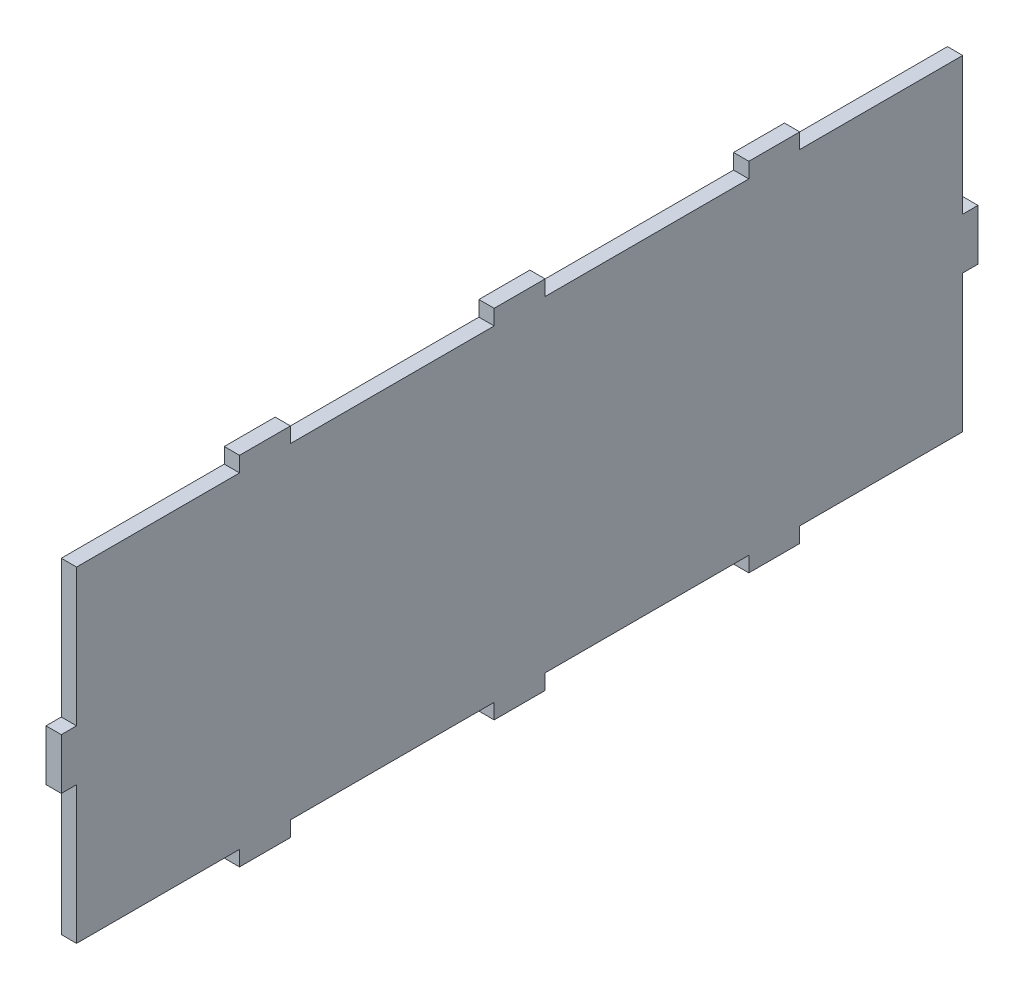
ISO-10303-21;
HEADER;
FILE_DESCRIPTION(('STEP AP214'),'2;1');
FILE_NAME('part.step','',(''),(''),'','','');
FILE_SCHEMA(('AUTOMOTIVE_DESIGN { 1 0 10303 214 1 1 1 1 }'));
ENDSEC;
DATA;
#1=APPLICATION_CONTEXT('core data for automotive mechanical design processes');
#2=APPLICATION_PROTOCOL_DEFINITION('international standard','automotive_design',2000,#1);
#3=PRODUCT_CONTEXT('',#1,'mechanical');
#4=PRODUCT('Part','Part','',(#3));
#5=PRODUCT_RELATED_PRODUCT_CATEGORY('part','',(#4));
#6=PRODUCT_DEFINITION_FORMATION('','',#4);
#7=PRODUCT_DEFINITION_CONTEXT('part definition',#1,'design');
#8=PRODUCT_DEFINITION('design','',#6,#7);
#9=PRODUCT_DEFINITION_SHAPE('','',#8);
#10=(LENGTH_UNIT() NAMED_UNIT(*) SI_UNIT(.MILLI.,.METRE.));
#11=(NAMED_UNIT(*) PLANE_ANGLE_UNIT() SI_UNIT($,.RADIAN.));
#12=(NAMED_UNIT(*) SI_UNIT($,.STERADIAN.) SOLID_ANGLE_UNIT());
#13=UNCERTAINTY_MEASURE_WITH_UNIT(LENGTH_MEASURE(1.E-05),#10,'distance_accuracy_value','');
#14=(GEOMETRIC_REPRESENTATION_CONTEXT(3) GLOBAL_UNCERTAINTY_ASSIGNED_CONTEXT((#13)) GLOBAL_UNIT_ASSIGNED_CONTEXT((#10,
#11,#12)) REPRESENTATION_CONTEXT('',''));
#15=CARTESIAN_POINT('',(0.,0.,0.));
#16=DIRECTION('',(0.,0.,1.));
#17=DIRECTION('',(1.,0.,0.));
#18=AXIS2_PLACEMENT_3D('',#15,#16,#17);
#19=CARTESIAN_POINT('',(3.,35.,-90.));
#20=DIRECTION('',(0.,0.,1.));
#21=DIRECTION('',(0.,-1.,0.));
#22=AXIS2_PLACEMENT_3D('',#19,#20,#21);
#23=PLANE('',#22);
#24=DIRECTION('',(1.,0.,0.));
#25=VECTOR('',#24,1.);
#26=CARTESIAN_POINT('',(-7.,5.,-90.));
#27=LINE('',#26,#25);
#28=CARTESIAN_POINT('',(0.,5.,-90.));
#29=VERTEX_POINT('',#28);
#30=CARTESIAN_POINT('',(3.,5.,-90.));
#31=VERTEX_POINT('',#30);
#32=EDGE_CURVE('E341',#29,#31,#27,.T.);
#33=ORIENTED_EDGE('',*,*,#32,.T.);
#34=DIRECTION('',(0.,1.,0.));
#35=VECTOR('',#34,1.);
#36=CARTESIAN_POINT('',(3.,35.,-90.));
#37=LINE('',#36,#35);
#38=CARTESIAN_POINT('',(3.,-5.,-90.));
#39=VERTEX_POINT('',#38);
#40=EDGE_CURVE('E448',#39,#31,#37,.T.);
#41=ORIENTED_EDGE('',*,*,#40,.F.);
#42=DIRECTION('',(1.,0.,0.));
#43=VECTOR('',#42,1.);
#44=CARTESIAN_POINT('',(-7.,-5.,-90.));
#45=LINE('',#44,#43);
#46=CARTESIAN_POINT('',(0.,-5.,-90.));
#47=VERTEX_POINT('',#46);
#48=EDGE_CURVE('E442',#47,#39,#45,.T.);
#49=ORIENTED_EDGE('',*,*,#48,.F.);
#50=DIRECTION('',(0.,1.,0.));
#51=VECTOR('',#50,1.);
#52=CARTESIAN_POINT('',(0.,35.,-90.));
#53=LINE('',#52,#51);
#54=EDGE_CURVE('E439',#47,#29,#53,.T.);
#55=ORIENTED_EDGE('',*,*,#54,.T.);
#56=EDGE_LOOP('',(#33,#41,#49,#55));
#57=FACE_BOUND('',#56,.T.);
#58=ADVANCED_FACE('F39',(#57),#23,.F.);
#59=CARTESIAN_POINT('',(3.,35.,90.));
#60=DIRECTION('',(0.,-1.,0.));
#61=DIRECTION('',(0.,0.,-1.));
#62=AXIS2_PLACEMENT_3D('',#59,#60,#61);
#63=PLANE('',#62);
#64=DIRECTION('',(1.,0.,0.));
#65=VECTOR('',#64,1.);
#66=CARTESIAN_POINT('',(-7.,35.,55.));
#67=LINE('',#66,#65);
#68=CARTESIAN_POINT('',(0.,35.,55.));
#69=VERTEX_POINT('',#68);
#70=CARTESIAN_POINT('',(3.,35.,55.));
#71=VERTEX_POINT('',#70);
#72=EDGE_CURVE('E417',#69,#71,#67,.T.);
#73=ORIENTED_EDGE('',*,*,#72,.T.);
#74=DIRECTION('',(0.,0.,1.));
#75=VECTOR('',#74,1.);
#76=CARTESIAN_POINT('',(3.,35.,90.));
#77=LINE('',#76,#75);
#78=CARTESIAN_POINT('',(3.,35.,45.));
#79=VERTEX_POINT('',#78);
#80=EDGE_CURVE('E451',#79,#71,#77,.T.);
#81=ORIENTED_EDGE('',*,*,#80,.F.);
#82=DIRECTION('',(1.,0.,0.));
#83=VECTOR('',#82,1.);
#84=CARTESIAN_POINT('',(-7.,35.,45.));
#85=LINE('',#84,#83);
#86=CARTESIAN_POINT('',(0.,35.,45.));
#87=VERTEX_POINT('',#86);
#88=EDGE_CURVE('E304',#87,#79,#85,.T.);
#89=ORIENTED_EDGE('',*,*,#88,.F.);
#90=DIRECTION('',(0.,0.,1.));
#91=VECTOR('',#90,1.);
#92=CARTESIAN_POINT('',(0.,35.,90.));
#93=LINE('',#92,#91);
#94=EDGE_CURVE('E466',#87,#69,#93,.T.);
#95=ORIENTED_EDGE('',*,*,#94,.T.);
#96=EDGE_LOOP('',(#73,#81,#89,#95));
#97=FACE_BOUND('',#96,.T.);
#98=ADVANCED_FACE('F614',(#97),#63,.F.);
#99=DIRECTION('',(1.,0.,0.));
#100=VECTOR('',#99,1.);
#101=CARTESIAN_POINT('',(-7.,35.,5.));
#102=LINE('',#101,#100);
#103=CARTESIAN_POINT('',(0.,35.,5.00000000000003));
#104=VERTEX_POINT('',#103);
#105=CARTESIAN_POINT('',(3.,35.,5.));
#106=VERTEX_POINT('',#105);
#107=EDGE_CURVE('E280',#104,#106,#102,.T.);
#108=ORIENTED_EDGE('',*,*,#107,.T.);
#109=CARTESIAN_POINT('',(3.,35.,-5.));
#110=VERTEX_POINT('',#109);
#111=EDGE_CURVE('E298',#110,#106,#77,.T.);
#112=ORIENTED_EDGE('',*,*,#111,.F.);
#113=DIRECTION('',(1.,0.,0.));
#114=VECTOR('',#113,1.);
#115=CARTESIAN_POINT('',(-7.,35.,-5.));
#116=LINE('',#115,#114);
#117=CARTESIAN_POINT('',(0.,35.,-5.));
#118=VERTEX_POINT('',#117);
#119=EDGE_CURVE('E319',#118,#110,#116,.T.);
#120=ORIENTED_EDGE('',*,*,#119,.F.);
#121=EDGE_CURVE('E469',#118,#104,#93,.T.);
#122=ORIENTED_EDGE('',*,*,#121,.T.);
#123=EDGE_LOOP('',(#108,#112,#120,#122));
#124=FACE_BOUND('',#123,.T.);
#125=ADVANCED_FACE('F622',(#124),#63,.F.);
#126=DIRECTION('',(1.,0.,0.));
#127=VECTOR('',#126,1.);
#128=CARTESIAN_POINT('',(-7.,35.,-45.));
#129=LINE('',#128,#127);
#130=CARTESIAN_POINT('',(0.,35.,-44.9999999999999));
#131=VERTEX_POINT('',#130);
#132=CARTESIAN_POINT('',(3.,35.,-45.));
#133=VERTEX_POINT('',#132);
#134=EDGE_CURVE('E321',#131,#133,#129,.T.);
#135=ORIENTED_EDGE('',*,*,#134,.T.);
#136=CARTESIAN_POINT('',(3.,35.,-55.));
#137=VERTEX_POINT('',#136);
#138=EDGE_CURVE('E455',#137,#133,#77,.T.);
#139=ORIENTED_EDGE('',*,*,#138,.F.);
#140=DIRECTION('',(1.,0.,0.));
#141=VECTOR('',#140,1.);
#142=CARTESIAN_POINT('',(-7.,35.,-55.));
#143=LINE('',#142,#141);
#144=CARTESIAN_POINT('',(0.,35.,-55.));
#145=VERTEX_POINT('',#144);
#146=EDGE_CURVE('E339',#145,#137,#143,.T.);
#147=ORIENTED_EDGE('',*,*,#146,.F.);
#148=EDGE_CURVE('E470',#145,#131,#93,.T.);
#149=ORIENTED_EDGE('',*,*,#148,.T.);
#150=EDGE_LOOP('',(#135,#139,#147,#149));
#151=FACE_BOUND('',#150,.T.);
#152=ADVANCED_FACE('F627',(#151),#63,.F.);
#153=CARTESIAN_POINT('',(3.,35.,90.));
#154=DIRECTION('',(0.,0.,-1.));
#155=DIRECTION('',(0.,1.,0.));
#156=AXIS2_PLACEMENT_3D('',#153,#154,#155);
#157=PLANE('',#156);
#158=DIRECTION('',(1.,0.,0.));
#159=VECTOR('',#158,1.);
#160=CARTESIAN_POINT('',(-7.,-5.,90.));
#161=LINE('',#160,#159);
#162=CARTESIAN_POINT('',(0.,-5.,90.));
#163=VERTEX_POINT('',#162);
#164=CARTESIAN_POINT('',(3.,-5.,90.));
#165=VERTEX_POINT('',#164);
#166=EDGE_CURVE('E396',#163,#165,#161,.T.);
#167=ORIENTED_EDGE('',*,*,#166,.T.);
#168=DIRECTION('',(0.,-1.,0.));
#169=VECTOR('',#168,1.);
#170=CARTESIAN_POINT('',(3.,35.,90.));
#171=LINE('',#170,#169);
#172=CARTESIAN_POINT('',(3.,5.,90.));
#173=VERTEX_POINT('',#172);
#174=EDGE_CURVE('E456',#173,#165,#171,.T.);
#175=ORIENTED_EDGE('',*,*,#174,.F.);
#176=DIRECTION('',(1.,0.,0.));
#177=VECTOR('',#176,1.);
#178=CARTESIAN_POINT('',(-7.,5.,90.));
#179=LINE('',#178,#177);
#180=CARTESIAN_POINT('',(0.,5.,90.));
#181=VERTEX_POINT('',#180);
#182=EDGE_CURVE('E385',#181,#173,#179,.T.);
#183=ORIENTED_EDGE('',*,*,#182,.F.);
#184=DIRECTION('',(0.,-1.,0.));
#185=VECTOR('',#184,1.);
#186=CARTESIAN_POINT('',(0.,35.,90.));
#187=LINE('',#186,#185);
#188=EDGE_CURVE('E471',#181,#163,#187,.T.);
#189=ORIENTED_EDGE('',*,*,#188,.T.);
#190=EDGE_LOOP('',(#167,#175,#183,#189));
#191=FACE_BOUND('',#190,.T.);
#192=ADVANCED_FACE('F594',(#191),#157,.F.);
#193=CARTESIAN_POINT('',(3.,-35.,90.));
#194=DIRECTION('',(0.,1.,0.));
#195=DIRECTION('',(0.,0.,1.));
#196=AXIS2_PLACEMENT_3D('',#193,#194,#195);
#197=PLANE('',#196);
#198=DIRECTION('',(1.,0.,0.));
#199=VECTOR('',#198,1.);
#200=CARTESIAN_POINT('',(-7.,-35.,-5.));
#201=LINE('',#200,#199);
#202=CARTESIAN_POINT('',(0.,-35.,-5.));
#203=VERTEX_POINT('',#202);
#204=CARTESIAN_POINT('',(3.,-35.,-5.));
#205=VERTEX_POINT('',#204);
#206=EDGE_CURVE('E360',#203,#205,#201,.T.);
#207=ORIENTED_EDGE('',*,*,#206,.T.);
#208=DIRECTION('',(0.,0.,-1.));
#209=VECTOR('',#208,1.);
#210=CARTESIAN_POINT('',(3.,-35.,90.));
#211=LINE('',#210,#209);
#212=CARTESIAN_POINT('',(3.,-35.,5.));
#213=VERTEX_POINT('',#212);
#214=EDGE_CURVE('E462',#213,#205,#211,.T.);
#215=ORIENTED_EDGE('',*,*,#214,.F.);
#216=DIRECTION('',(1.,0.,0.));
#217=VECTOR('',#216,1.);
#218=CARTESIAN_POINT('',(-7.,-35.,5.));
#219=LINE('',#218,#217);
#220=CARTESIAN_POINT('',(0.,-35.,5.));
#221=VERTEX_POINT('',#220);
#222=EDGE_CURVE('E351',#221,#213,#219,.T.);
#223=ORIENTED_EDGE('',*,*,#222,.F.);
#224=DIRECTION('',(0.,0.,-1.));
#225=VECTOR('',#224,1.);
#226=CARTESIAN_POINT('',(0.,-35.,90.));
#227=LINE('',#226,#225);
#228=EDGE_CURVE('E477',#221,#203,#227,.T.);
#229=ORIENTED_EDGE('',*,*,#228,.T.);
#230=EDGE_LOOP('',(#207,#215,#223,#229));
#231=FACE_BOUND('',#230,.T.);
#232=ADVANCED_FACE('F563',(#231),#197,.F.);
#233=DIRECTION('',(1.,0.,0.));
#234=VECTOR('',#233,1.);
#235=CARTESIAN_POINT('',(-7.,-35.,45.));
#236=LINE('',#235,#234);
#237=CARTESIAN_POINT('',(0.,-35.,45.));
#238=VERTEX_POINT('',#237);
#239=CARTESIAN_POINT('',(3.,-35.,45.));
#240=VERTEX_POINT('',#239);
#241=EDGE_CURVE('E376',#238,#240,#236,.T.);
#242=ORIENTED_EDGE('',*,*,#241,.T.);
#243=CARTESIAN_POINT('',(3.,-35.,55.));
#244=VERTEX_POINT('',#243);
#245=EDGE_CURVE('E463',#244,#240,#211,.T.);
#246=ORIENTED_EDGE('',*,*,#245,.F.);
#247=DIRECTION('',(1.,0.,0.));
#248=VECTOR('',#247,1.);
#249=CARTESIAN_POINT('',(-7.,-35.,55.));
#250=LINE('',#249,#248);
#251=CARTESIAN_POINT('',(0.,-35.,55.));
#252=VERTEX_POINT('',#251);
#253=EDGE_CURVE('E369',#252,#244,#250,.T.);
#254=ORIENTED_EDGE('',*,*,#253,.F.);
#255=EDGE_CURVE('E452',#252,#238,#227,.T.);
#256=ORIENTED_EDGE('',*,*,#255,.T.);
#257=EDGE_LOOP('',(#242,#246,#254,#256));
#258=FACE_BOUND('',#257,.T.);
#259=ADVANCED_FACE('F569',(#258),#197,.F.);
#260=CARTESIAN_POINT('',(3.,-35.,-45.));
#261=VERTEX_POINT('',#260);
#262=CARTESIAN_POINT('',(3.,-35.,-55.));
#263=VERTEX_POINT('',#262);
#264=EDGE_CURVE('E459',#261,#263,#211,.T.);
#265=ORIENTED_EDGE('',*,*,#264,.F.);
#266=DIRECTION('',(1.,0.,0.));
#267=VECTOR('',#266,1.);
#268=CARTESIAN_POINT('',(-7.,-35.,-45.));
#269=LINE('',#268,#267);
#270=CARTESIAN_POINT('',(0.,-35.,-45.));
#271=VERTEX_POINT('',#270);
#272=EDGE_CURVE('E357',#271,#261,#269,.T.);
#273=ORIENTED_EDGE('',*,*,#272,.F.);
#274=CARTESIAN_POINT('',(0.,-35.,-54.9999999999999));
#275=VERTEX_POINT('',#274);
#276=EDGE_CURVE('E474',#271,#275,#227,.T.);
#277=ORIENTED_EDGE('',*,*,#276,.T.);
#278=DIRECTION('',(1.,0.,0.));
#279=VECTOR('',#278,1.);
#280=CARTESIAN_POINT('',(-7.,-35.,-55.));
#281=LINE('',#280,#279);
#282=EDGE_CURVE('E444',#275,#263,#281,.T.);
#283=ORIENTED_EDGE('',*,*,#282,.T.);
#284=EDGE_LOOP('',(#265,#273,#277,#283));
#285=FACE_BOUND('',#284,.T.);
#286=ADVANCED_FACE('F675',(#285),#197,.F.);
#287=CARTESIAN_POINT('',(3.,0.,0.));
#288=DIRECTION('',(1.,0.,0.));
#289=DIRECTION('',(0.,0.,-1.));
#290=AXIS2_PLACEMENT_3D('',#287,#288,#289);
#291=PLANE('',#290);
#292=DIRECTION('',(0.,1.,0.));
#293=VECTOR('',#292,1.);
#294=CARTESIAN_POINT('',(3.,0.,-45.));
#295=LINE('',#294,#293);
#296=CARTESIAN_POINT('',(3.,-32.,-45.));
#297=VERTEX_POINT('',#296);
#298=EDGE_CURVE('E347',#261,#297,#295,.T.);
#299=ORIENTED_EDGE('',*,*,#298,.F.);
#300=ORIENTED_EDGE('',*,*,#264,.T.);
#301=DIRECTION('',(0.,1.,0.));
#302=VECTOR('',#301,1.);
#303=CARTESIAN_POINT('',(3.,0.,-55.));
#304=LINE('',#303,#302);
#305=CARTESIAN_POINT('',(3.,-32.,-55.));
#306=VERTEX_POINT('',#305);
#307=EDGE_CURVE('E427',#263,#306,#304,.T.);
#308=ORIENTED_EDGE('',*,*,#307,.T.);
#309=DIRECTION('',(0.,0.,1.));
#310=VECTOR('',#309,1.);
#311=CARTESIAN_POINT('',(3.,-32.,0.));
#312=LINE('',#311,#310);
#313=CARTESIAN_POINT('',(3.,-32.,-87.));
#314=VERTEX_POINT('',#313);
#315=EDGE_CURVE('E359',#314,#306,#312,.T.);
#316=ORIENTED_EDGE('',*,*,#315,.F.);
#317=DIRECTION('',(0.,-1.,0.));
#318=VECTOR('',#317,1.);
#319=CARTESIAN_POINT('',(3.,0.,-87.));
#320=LINE('',#319,#318);
#321=CARTESIAN_POINT('',(3.,-5.,-87.));
#322=VERTEX_POINT('',#321);
#323=EDGE_CURVE('E433',#322,#314,#320,.T.);
#324=ORIENTED_EDGE('',*,*,#323,.F.);
#325=DIRECTION('',(0.,0.,-1.));
#326=VECTOR('',#325,1.);
#327=CARTESIAN_POINT('',(3.,-5.,0.));
#328=LINE('',#327,#326);
#329=EDGE_CURVE('E430',#322,#39,#328,.T.);
#330=ORIENTED_EDGE('',*,*,#329,.T.);
#331=ORIENTED_EDGE('',*,*,#40,.T.);
#332=DIRECTION('',(0.,0.,1.));
#333=VECTOR('',#332,1.);
#334=CARTESIAN_POINT('',(3.,4.99999999999998,0.));
#335=LINE('',#334,#333);
#336=CARTESIAN_POINT('',(3.,5.,-87.));
#337=VERTEX_POINT('',#336);
#338=EDGE_CURVE('E331',#31,#337,#335,.T.);
#339=ORIENTED_EDGE('',*,*,#338,.T.);
#340=DIRECTION('',(0.,-1.,0.));
#341=VECTOR('',#340,1.);
#342=CARTESIAN_POINT('',(3.,0.,-87.));
#343=LINE('',#342,#341);
#344=CARTESIAN_POINT('',(3.,32.,-87.));
#345=VERTEX_POINT('',#344);
#346=EDGE_CURVE('E328',#345,#337,#343,.T.);
#347=ORIENTED_EDGE('',*,*,#346,.F.);
#348=DIRECTION('',(0.,0.,1.));
#349=VECTOR('',#348,1.);
#350=CARTESIAN_POINT('',(3.,32.,0.));
#351=LINE('',#350,#349);
#352=CARTESIAN_POINT('',(3.,32.,-55.));
#353=VERTEX_POINT('',#352);
#354=EDGE_CURVE('E325',#345,#353,#351,.T.);
#355=ORIENTED_EDGE('',*,*,#354,.T.);
#356=DIRECTION('',(0.,-1.,0.));
#357=VECTOR('',#356,1.);
#358=CARTESIAN_POINT('',(3.,0.,-55.));
#359=LINE('',#358,#357);
#360=EDGE_CURVE('E334',#137,#353,#359,.T.);
#361=ORIENTED_EDGE('',*,*,#360,.F.);
#362=ORIENTED_EDGE('',*,*,#138,.T.);
#363=DIRECTION('',(0.,-1.,0.));
#364=VECTOR('',#363,1.);
#365=CARTESIAN_POINT('',(3.,0.,-45.));
#366=LINE('',#365,#364);
#367=CARTESIAN_POINT('',(3.,32.,-45.));
#368=VERTEX_POINT('',#367);
#369=EDGE_CURVE('E310',#133,#368,#366,.T.);
#370=ORIENTED_EDGE('',*,*,#369,.T.);
#371=DIRECTION('',(0.,0.,1.));
#372=VECTOR('',#371,1.);
#373=CARTESIAN_POINT('',(3.,32.,0.));
#374=LINE('',#373,#372);
#375=CARTESIAN_POINT('',(3.,32.,-5.));
#376=VERTEX_POINT('',#375);
#377=EDGE_CURVE('E307',#368,#376,#374,.T.);
#378=ORIENTED_EDGE('',*,*,#377,.T.);
#379=DIRECTION('',(0.,-1.,0.));
#380=VECTOR('',#379,1.);
#381=CARTESIAN_POINT('',(3.,0.,-5.));
#382=LINE('',#381,#380);
#383=EDGE_CURVE('E314',#110,#376,#382,.T.);
#384=ORIENTED_EDGE('',*,*,#383,.F.);
#385=ORIENTED_EDGE('',*,*,#111,.T.);
#386=DIRECTION('',(0.,-1.,0.));
#387=VECTOR('',#386,1.);
#388=CARTESIAN_POINT('',(3.,0.,4.99999999999999));
#389=LINE('',#388,#387);
#390=CARTESIAN_POINT('',(3.,32.,5.));
#391=VERTEX_POINT('',#390);
#392=EDGE_CURVE('E274',#106,#391,#389,.T.);
#393=ORIENTED_EDGE('',*,*,#392,.T.);
#394=DIRECTION('',(0.,0.,1.));
#395=VECTOR('',#394,1.);
#396=CARTESIAN_POINT('',(3.,32.,0.));
#397=LINE('',#396,#395);
#398=CARTESIAN_POINT('',(3.,32.,45.));
#399=VERTEX_POINT('',#398);
#400=EDGE_CURVE('E284',#391,#399,#397,.T.);
#401=ORIENTED_EDGE('',*,*,#400,.T.);
#402=DIRECTION('',(0.,-1.,0.));
#403=VECTOR('',#402,1.);
#404=CARTESIAN_POINT('',(3.,0.,45.));
#405=LINE('',#404,#403);
#406=EDGE_CURVE('E281',#79,#399,#405,.T.);
#407=ORIENTED_EDGE('',*,*,#406,.F.);
#408=ORIENTED_EDGE('',*,*,#80,.T.);
#409=DIRECTION('',(0.,-1.,0.));
#410=VECTOR('',#409,1.);
#411=CARTESIAN_POINT('',(3.,-1.27213054904966E-13,54.9999999999999));
#412=LINE('',#411,#410);
#413=CARTESIAN_POINT('',(3.,32.,55.));
#414=VERTEX_POINT('',#413);
#415=EDGE_CURVE('E412',#71,#414,#412,.T.);
#416=ORIENTED_EDGE('',*,*,#415,.T.);
#417=DIRECTION('',(0.,0.,1.));
#418=VECTOR('',#417,1.);
#419=CARTESIAN_POINT('',(3.,32.,0.));
#420=LINE('',#419,#418);
#421=CARTESIAN_POINT('',(3.,32.,87.));
#422=VERTEX_POINT('',#421);
#423=EDGE_CURVE('E409',#414,#422,#420,.T.);
#424=ORIENTED_EDGE('',*,*,#423,.T.);
#425=DIRECTION('',(0.,1.,0.));
#426=VECTOR('',#425,1.);
#427=CARTESIAN_POINT('',(3.,0.,87.));
#428=LINE('',#427,#426);
#429=CARTESIAN_POINT('',(3.,5.,87.));
#430=VERTEX_POINT('',#429);
#431=EDGE_CURVE('E406',#430,#422,#428,.T.);
#432=ORIENTED_EDGE('',*,*,#431,.F.);
#433=DIRECTION('',(0.,0.,-1.));
#434=VECTOR('',#433,1.);
#435=CARTESIAN_POINT('',(3.,5.,0.));
#436=LINE('',#435,#434);
#437=EDGE_CURVE('E303',#173,#430,#436,.T.);
#438=ORIENTED_EDGE('',*,*,#437,.F.);
#439=ORIENTED_EDGE('',*,*,#174,.T.);
#440=DIRECTION('',(0.,0.,-1.));
#441=VECTOR('',#440,1.);
#442=CARTESIAN_POINT('',(3.,-5.,0.));
#443=LINE('',#442,#441);
#444=CARTESIAN_POINT('',(3.,-5.,87.));
#445=VERTEX_POINT('',#444);
#446=EDGE_CURVE('E391',#165,#445,#443,.T.);
#447=ORIENTED_EDGE('',*,*,#446,.T.);
#448=DIRECTION('',(0.,-1.,0.));
#449=VECTOR('',#448,1.);
#450=CARTESIAN_POINT('',(3.,0.,87.));
#451=LINE('',#450,#449);
#452=CARTESIAN_POINT('',(3.,-32.,87.));
#453=VERTEX_POINT('',#452);
#454=EDGE_CURVE('E388',#445,#453,#451,.T.);
#455=ORIENTED_EDGE('',*,*,#454,.T.);
#456=DIRECTION('',(0.,0.,1.));
#457=VECTOR('',#456,1.);
#458=CARTESIAN_POINT('',(3.,-32.,0.));
#459=LINE('',#458,#457);
#460=CARTESIAN_POINT('',(3.,-32.,55.));
#461=VERTEX_POINT('',#460);
#462=EDGE_CURVE('E384',#461,#453,#459,.T.);
#463=ORIENTED_EDGE('',*,*,#462,.F.);
#464=DIRECTION('',(0.,1.,0.));
#465=VECTOR('',#464,1.);
#466=CARTESIAN_POINT('',(3.,0.,55.));
#467=LINE('',#466,#465);
#468=EDGE_CURVE('E381',#244,#461,#467,.T.);
#469=ORIENTED_EDGE('',*,*,#468,.F.);
#470=ORIENTED_EDGE('',*,*,#245,.T.);
#471=DIRECTION('',(0.,1.,0.));
#472=VECTOR('',#471,1.);
#473=CARTESIAN_POINT('',(3.,0.,45.));
#474=LINE('',#473,#472);
#475=CARTESIAN_POINT('',(3.,-32.,45.));
#476=VERTEX_POINT('',#475);
#477=EDGE_CURVE('E371',#240,#476,#474,.T.);
#478=ORIENTED_EDGE('',*,*,#477,.T.);
#479=DIRECTION('',(0.,0.,1.));
#480=VECTOR('',#479,1.);
#481=CARTESIAN_POINT('',(3.,-32.,0.));
#482=LINE('',#481,#480);
#483=CARTESIAN_POINT('',(3.,-32.,5.));
#484=VERTEX_POINT('',#483);
#485=EDGE_CURVE('E368',#484,#476,#482,.T.);
#486=ORIENTED_EDGE('',*,*,#485,.F.);
#487=DIRECTION('',(0.,1.,0.));
#488=VECTOR('',#487,1.);
#489=CARTESIAN_POINT('',(3.,0.,5.));
#490=LINE('',#489,#488);
#491=EDGE_CURVE('E365',#213,#484,#490,.T.);
#492=ORIENTED_EDGE('',*,*,#491,.F.);
#493=ORIENTED_EDGE('',*,*,#214,.T.);
#494=DIRECTION('',(0.,1.,0.));
#495=VECTOR('',#494,1.);
#496=CARTESIAN_POINT('',(3.,0.,-5.00000000000032));
#497=LINE('',#496,#495);
#498=CARTESIAN_POINT('',(3.,-32.,-5.00000000000003));
#499=VERTEX_POINT('',#498);
#500=EDGE_CURVE('E353',#205,#499,#497,.T.);
#501=ORIENTED_EDGE('',*,*,#500,.T.);
#502=DIRECTION('',(0.,0.,1.));
#503=VECTOR('',#502,1.);
#504=CARTESIAN_POINT('',(3.,-32.,0.));
#505=LINE('',#504,#503);
#506=EDGE_CURVE('E350',#297,#499,#505,.T.);
#507=ORIENTED_EDGE('',*,*,#506,.F.);
#508=EDGE_LOOP('',(#299,#300,#308,#316,#324,#330,#331,#339,#347,#355,#361,#362,#370,#378,#384,
#385,#393,#401,#407,#408,#416,#424,#432,#438,#439,#447,#455,#463,#469,#470,#478,#486,#492,#493,
#501,#507));
#509=FACE_BOUND('',#508,.T.);
#510=ADVANCED_FACE('F295',(#509),#291,.T.);
#511=CARTESIAN_POINT('',(0.,0.,0.));
#512=DIRECTION('',(1.,0.,0.));
#513=DIRECTION('',(0.,0.,-1.));
#514=AXIS2_PLACEMENT_3D('',#511,#512,#513);
#515=PLANE('',#514);
#516=ORIENTED_EDGE('',*,*,#276,.F.);
#517=DIRECTION('',(0.,1.,0.));
#518=VECTOR('',#517,1.);
#519=CARTESIAN_POINT('',(0.,0.,-45.));
#520=LINE('',#519,#518);
#521=CARTESIAN_POINT('',(0.,-32.,-45.));
#522=VERTEX_POINT('',#521);
#523=EDGE_CURVE('E11',#271,#522,#520,.T.);
#524=ORIENTED_EDGE('',*,*,#523,.T.);
#525=DIRECTION('',(0.,0.,1.));
#526=VECTOR('',#525,1.);
#527=CARTESIAN_POINT('',(0.,-32.,0.));
#528=LINE('',#527,#526);
#529=CARTESIAN_POINT('',(0.,-32.,-5.00000000000003));
#530=VERTEX_POINT('',#529);
#531=EDGE_CURVE('E542',#522,#530,#528,.T.);
#532=ORIENTED_EDGE('',*,*,#531,.T.);
#533=DIRECTION('',(0.,1.,0.));
#534=VECTOR('',#533,1.);
#535=CARTESIAN_POINT('',(0.,0.,-5.00000000000032));
#536=LINE('',#535,#534);
#537=EDGE_CURVE('E46',#203,#530,#536,.T.);
#538=ORIENTED_EDGE('',*,*,#537,.F.);
#539=ORIENTED_EDGE('',*,*,#228,.F.);
#540=DIRECTION('',(0.,1.,0.));
#541=VECTOR('',#540,1.);
#542=CARTESIAN_POINT('',(0.,0.,5.));
#543=LINE('',#542,#541);
#544=CARTESIAN_POINT('',(0.,-32.,5.));
#545=VERTEX_POINT('',#544);
#546=EDGE_CURVE('E539',#221,#545,#543,.T.);
#547=ORIENTED_EDGE('',*,*,#546,.T.);
#548=DIRECTION('',(0.,0.,1.));
#549=VECTOR('',#548,1.);
#550=CARTESIAN_POINT('',(0.,-32.,0.));
#551=LINE('',#550,#549);
#552=CARTESIAN_POINT('',(0.,-32.,45.));
#553=VERTEX_POINT('',#552);
#554=EDGE_CURVE('E534',#545,#553,#551,.T.);
#555=ORIENTED_EDGE('',*,*,#554,.T.);
#556=DIRECTION('',(0.,1.,0.));
#557=VECTOR('',#556,1.);
#558=CARTESIAN_POINT('',(0.,0.,45.));
#559=LINE('',#558,#557);
#560=EDGE_CURVE('E537',#238,#553,#559,.T.);
#561=ORIENTED_EDGE('',*,*,#560,.F.);
#562=ORIENTED_EDGE('',*,*,#255,.F.);
#563=DIRECTION('',(0.,1.,0.));
#564=VECTOR('',#563,1.);
#565=CARTESIAN_POINT('',(0.,0.,55.));
#566=LINE('',#565,#564);
#567=CARTESIAN_POINT('',(0.,-32.,55.));
#568=VERTEX_POINT('',#567);
#569=EDGE_CURVE('E531',#252,#568,#566,.T.);
#570=ORIENTED_EDGE('',*,*,#569,.T.);
#571=DIRECTION('',(0.,0.,1.));
#572=VECTOR('',#571,1.);
#573=CARTESIAN_POINT('',(0.,-32.,0.));
#574=LINE('',#573,#572);
#575=CARTESIAN_POINT('',(0.,-32.,87.));
#576=VERTEX_POINT('',#575);
#577=EDGE_CURVE('E523',#568,#576,#574,.T.);
#578=ORIENTED_EDGE('',*,*,#577,.T.);
#579=DIRECTION('',(0.,-1.,0.));
#580=VECTOR('',#579,1.);
#581=CARTESIAN_POINT('',(0.,0.,87.));
#582=LINE('',#581,#580);
#583=CARTESIAN_POINT('',(0.,-5.,87.));
#584=VERTEX_POINT('',#583);
#585=EDGE_CURVE('E526',#584,#576,#582,.T.);
#586=ORIENTED_EDGE('',*,*,#585,.F.);
#587=DIRECTION('',(0.,0.,-1.));
#588=VECTOR('',#587,1.);
#589=CARTESIAN_POINT('',(0.,-5.,0.));
#590=LINE('',#589,#588);
#591=EDGE_CURVE('E529',#163,#584,#590,.T.);
#592=ORIENTED_EDGE('',*,*,#591,.F.);
#593=ORIENTED_EDGE('',*,*,#188,.F.);
#594=DIRECTION('',(0.,0.,-1.));
#595=VECTOR('',#594,1.);
#596=CARTESIAN_POINT('',(0.,5.,0.));
#597=LINE('',#596,#595);
#598=CARTESIAN_POINT('',(0.,5.,87.));
#599=VERTEX_POINT('',#598);
#600=EDGE_CURVE('E520',#181,#599,#597,.T.);
#601=ORIENTED_EDGE('',*,*,#600,.T.);
#602=DIRECTION('',(0.,1.,0.));
#603=VECTOR('',#602,1.);
#604=CARTESIAN_POINT('',(0.,0.,87.));
#605=LINE('',#604,#603);
#606=CARTESIAN_POINT('',(0.,32.,87.));
#607=VERTEX_POINT('',#606);
#608=EDGE_CURVE('E512',#599,#607,#605,.T.);
#609=ORIENTED_EDGE('',*,*,#608,.T.);
#610=DIRECTION('',(0.,0.,1.));
#611=VECTOR('',#610,1.);
#612=CARTESIAN_POINT('',(0.,32.,0.));
#613=LINE('',#612,#611);
#614=CARTESIAN_POINT('',(0.,32.,55.));
#615=VERTEX_POINT('',#614);
#616=EDGE_CURVE('E515',#615,#607,#613,.T.);
#617=ORIENTED_EDGE('',*,*,#616,.F.);
#618=DIRECTION('',(0.,-1.,0.));
#619=VECTOR('',#618,1.);
#620=CARTESIAN_POINT('',(0.,-1.27213054904966E-13,54.9999999999999));
#621=LINE('',#620,#619);
#622=EDGE_CURVE('E518',#69,#615,#621,.T.);
#623=ORIENTED_EDGE('',*,*,#622,.F.);
#624=ORIENTED_EDGE('',*,*,#94,.F.);
#625=DIRECTION('',(0.,-1.,0.));
#626=VECTOR('',#625,1.);
#627=CARTESIAN_POINT('',(0.,0.,45.));
#628=LINE('',#627,#626);
#629=CARTESIAN_POINT('',(0.,32.,45.));
#630=VERTEX_POINT('',#629);
#631=EDGE_CURVE('E509',#87,#630,#628,.T.);
#632=ORIENTED_EDGE('',*,*,#631,.T.);
#633=DIRECTION('',(0.,0.,1.));
#634=VECTOR('',#633,1.);
#635=CARTESIAN_POINT('',(0.,32.,0.));
#636=LINE('',#635,#634);
#637=CARTESIAN_POINT('',(0.,32.,5.));
#638=VERTEX_POINT('',#637);
#639=EDGE_CURVE('E507',#638,#630,#636,.T.);
#640=ORIENTED_EDGE('',*,*,#639,.F.);
#641=DIRECTION('',(0.,-1.,0.));
#642=VECTOR('',#641,1.);
#643=CARTESIAN_POINT('',(0.,0.,4.99999999999999));
#644=LINE('',#643,#642);
#645=EDGE_CURVE('E277',#104,#638,#644,.T.);
#646=ORIENTED_EDGE('',*,*,#645,.F.);
#647=ORIENTED_EDGE('',*,*,#121,.F.);
#648=DIRECTION('',(0.,-1.,0.));
#649=VECTOR('',#648,1.);
#650=CARTESIAN_POINT('',(0.,0.,-5.));
#651=LINE('',#650,#649);
#652=CARTESIAN_POINT('',(0.,32.,-5.));
#653=VERTEX_POINT('',#652);
#654=EDGE_CURVE('E503',#118,#653,#651,.T.);
#655=ORIENTED_EDGE('',*,*,#654,.T.);
#656=DIRECTION('',(0.,0.,1.));
#657=VECTOR('',#656,1.);
#658=CARTESIAN_POINT('',(0.,32.,0.));
#659=LINE('',#658,#657);
#660=CARTESIAN_POINT('',(0.,32.,-45.));
#661=VERTEX_POINT('',#660);
#662=EDGE_CURVE('E501',#661,#653,#659,.T.);
#663=ORIENTED_EDGE('',*,*,#662,.F.);
#664=DIRECTION('',(0.,-1.,0.));
#665=VECTOR('',#664,1.);
#666=CARTESIAN_POINT('',(0.,0.,-45.));
#667=LINE('',#666,#665);
#668=EDGE_CURVE('E499',#131,#661,#667,.T.);
#669=ORIENTED_EDGE('',*,*,#668,.F.);
#670=ORIENTED_EDGE('',*,*,#148,.F.);
#671=DIRECTION('',(0.,-1.,0.));
#672=VECTOR('',#671,1.);
#673=CARTESIAN_POINT('',(0.,0.,-55.));
#674=LINE('',#673,#672);
#675=CARTESIAN_POINT('',(0.,32.,-55.));
#676=VERTEX_POINT('',#675);
#677=EDGE_CURVE('E496',#145,#676,#674,.T.);
#678=ORIENTED_EDGE('',*,*,#677,.T.);
#679=DIRECTION('',(0.,0.,1.));
#680=VECTOR('',#679,1.);
#681=CARTESIAN_POINT('',(0.,32.,0.));
#682=LINE('',#681,#680);
#683=CARTESIAN_POINT('',(0.,32.,-87.));
#684=VERTEX_POINT('',#683);
#685=EDGE_CURVE('E494',#684,#676,#682,.T.);
#686=ORIENTED_EDGE('',*,*,#685,.F.);
#687=DIRECTION('',(0.,-1.,0.));
#688=VECTOR('',#687,1.);
#689=CARTESIAN_POINT('',(0.,0.,-87.));
#690=LINE('',#689,#688);
#691=CARTESIAN_POINT('',(0.,5.,-87.));
#692=VERTEX_POINT('',#691);
#693=EDGE_CURVE('E488',#684,#692,#690,.T.);
#694=ORIENTED_EDGE('',*,*,#693,.T.);
#695=DIRECTION('',(0.,0.,1.));
#696=VECTOR('',#695,1.);
#697=CARTESIAN_POINT('',(0.,4.99999999999998,0.));
#698=LINE('',#697,#696);
#699=EDGE_CURVE('E491',#29,#692,#698,.T.);
#700=ORIENTED_EDGE('',*,*,#699,.F.);
#701=ORIENTED_EDGE('',*,*,#54,.F.);
#702=DIRECTION('',(0.,0.,-1.));
#703=VECTOR('',#702,1.);
#704=CARTESIAN_POINT('',(0.,-5.,0.));
#705=LINE('',#704,#703);
#706=CARTESIAN_POINT('',(0.,-5.,-87.));
#707=VERTEX_POINT('',#706);
#708=EDGE_CURVE('E486',#707,#47,#705,.T.);
#709=ORIENTED_EDGE('',*,*,#708,.F.);
#710=DIRECTION('',(0.,-1.,0.));
#711=VECTOR('',#710,1.);
#712=CARTESIAN_POINT('',(0.,0.,-87.));
#713=LINE('',#712,#711);
#714=CARTESIAN_POINT('',(0.,-32.,-87.));
#715=VERTEX_POINT('',#714);
#716=EDGE_CURVE('E483',#707,#715,#713,.T.);
#717=ORIENTED_EDGE('',*,*,#716,.T.);
#718=DIRECTION('',(0.,0.,1.));
#719=VECTOR('',#718,1.);
#720=CARTESIAN_POINT('',(0.,-32.,0.));
#721=LINE('',#720,#719);
#722=CARTESIAN_POINT('',(0.,-32.,-55.));
#723=VERTEX_POINT('',#722);
#724=EDGE_CURVE('E480',#715,#723,#721,.T.);
#725=ORIENTED_EDGE('',*,*,#724,.T.);
#726=DIRECTION('',(0.,1.,0.));
#727=VECTOR('',#726,1.);
#728=CARTESIAN_POINT('',(0.,0.,-55.));
#729=LINE('',#728,#727);
#730=EDGE_CURVE('E478',#275,#723,#729,.T.);
#731=ORIENTED_EDGE('',*,*,#730,.F.);
#732=EDGE_LOOP('',(#516,#524,#532,#538,#539,#547,#555,#561,#562,#570,#578,#586,#592,#593,#601,
#609,#617,#623,#624,#632,#640,#646,#647,#655,#663,#669,#670,#678,#686,#694,#700,#701,#709,#717,
#725,#731));
#733=FACE_BOUND('',#732,.T.);
#734=ADVANCED_FACE('F551',(#733),#515,.F.);
#735=CARTESIAN_POINT('',(-7.,-32.,0.));
#736=DIRECTION('',(0.,1.,0.));
#737=DIRECTION('',(0.,0.,1.));
#738=AXIS2_PLACEMENT_3D('',#735,#736,#737);
#739=PLANE('',#738);
#740=DIRECTION('',(1.,0.,0.));
#741=VECTOR('',#740,1.);
#742=CARTESIAN_POINT('',(-7.,-32.,-87.));
#743=LINE('',#742,#741);
#744=EDGE_CURVE('E437',#715,#314,#743,.T.);
#745=ORIENTED_EDGE('',*,*,#744,.T.);
#746=ORIENTED_EDGE('',*,*,#315,.T.);
#747=DIRECTION('',(1.,0.,0.));
#748=VECTOR('',#747,1.);
#749=CARTESIAN_POINT('',(-7.,-32.,-55.));
#750=LINE('',#749,#748);
#751=EDGE_CURVE('E436',#723,#306,#750,.T.);
#752=ORIENTED_EDGE('',*,*,#751,.F.);
#753=ORIENTED_EDGE('',*,*,#724,.F.);
#754=EDGE_LOOP('',(#745,#746,#752,#753));
#755=FACE_BOUND('',#754,.T.);
#756=ADVANCED_FACE('F670',(#755),#739,.F.);
#757=CARTESIAN_POINT('',(-7.,0.,-87.));
#758=DIRECTION('',(0.,0.,1.));
#759=DIRECTION('',(1.,0.,0.));
#760=AXIS2_PLACEMENT_3D('',#757,#758,#759);
#761=PLANE('',#760);
#762=DIRECTION('',(1.,0.,0.));
#763=VECTOR('',#762,1.);
#764=CARTESIAN_POINT('',(-7.,-5.,-87.));
#765=LINE('',#764,#763);
#766=EDGE_CURVE('E440',#707,#322,#765,.T.);
#767=ORIENTED_EDGE('',*,*,#766,.T.);
#768=ORIENTED_EDGE('',*,*,#323,.T.);
#769=ORIENTED_EDGE('',*,*,#744,.F.);
#770=ORIENTED_EDGE('',*,*,#716,.F.);
#771=EDGE_LOOP('',(#767,#768,#769,#770));
#772=FACE_BOUND('',#771,.T.);
#773=ADVANCED_FACE('F668',(#772),#761,.F.);
#774=CARTESIAN_POINT('',(-7.,-5.,0.));
#775=DIRECTION('',(0.,-1.,0.));
#776=DIRECTION('',(0.,0.,-1.));
#777=AXIS2_PLACEMENT_3D('',#774,#775,#776);
#778=PLANE('',#777);
#779=ORIENTED_EDGE('',*,*,#708,.T.);
#780=ORIENTED_EDGE('',*,*,#48,.T.);
#781=ORIENTED_EDGE('',*,*,#329,.F.);
#782=ORIENTED_EDGE('',*,*,#766,.F.);
#783=EDGE_LOOP('',(#779,#780,#781,#782));
#784=FACE_BOUND('',#783,.T.);
#785=ADVANCED_FACE('F663',(#784),#778,.T.);
#786=CARTESIAN_POINT('',(-7.,0.,-55.));
#787=DIRECTION('',(0.,0.,-1.));
#788=DIRECTION('',(-1.,0.,0.));
#789=AXIS2_PLACEMENT_3D('',#786,#787,#788);
#790=PLANE('',#789);
#791=ORIENTED_EDGE('',*,*,#730,.T.);
#792=ORIENTED_EDGE('',*,*,#751,.T.);
#793=ORIENTED_EDGE('',*,*,#307,.F.);
#794=ORIENTED_EDGE('',*,*,#282,.F.);
#795=EDGE_LOOP('',(#791,#792,#793,#794));
#796=FACE_BOUND('',#795,.T.);
#797=ADVANCED_FACE('F673',(#796),#790,.T.);
#798=CARTESIAN_POINT('',(-7.,32.,0.));
#799=DIRECTION('',(0.,1.,0.));
#800=DIRECTION('',(0.,0.,1.));
#801=AXIS2_PLACEMENT_3D('',#798,#799,#800);
#802=PLANE('',#801);
#803=ORIENTED_EDGE('',*,*,#685,.T.);
#804=DIRECTION('',(1.,0.,0.));
#805=VECTOR('',#804,1.);
#806=CARTESIAN_POINT('',(-7.,32.,-55.));
#807=LINE('',#806,#805);
#808=EDGE_CURVE('E311',#676,#353,#807,.T.);
#809=ORIENTED_EDGE('',*,*,#808,.T.);
#810=ORIENTED_EDGE('',*,*,#354,.F.);
#811=DIRECTION('',(1.,0.,0.));
#812=VECTOR('',#811,1.);
#813=CARTESIAN_POINT('',(-7.,32.,-87.));
#814=LINE('',#813,#812);
#815=EDGE_CURVE('E337',#684,#345,#814,.T.);
#816=ORIENTED_EDGE('',*,*,#815,.F.);
#817=EDGE_LOOP('',(#803,#809,#810,#816));
#818=FACE_BOUND('',#817,.T.);
#819=ADVANCED_FACE('F647',(#818),#802,.T.);
#820=CARTESIAN_POINT('',(-7.,0.,-55.));
#821=DIRECTION('',(0.,0.,1.));
#822=DIRECTION('',(1.,0.,0.));
#823=AXIS2_PLACEMENT_3D('',#820,#821,#822);
#824=PLANE('',#823);
#825=ORIENTED_EDGE('',*,*,#146,.T.);
#826=ORIENTED_EDGE('',*,*,#360,.T.);
#827=ORIENTED_EDGE('',*,*,#808,.F.);
#828=ORIENTED_EDGE('',*,*,#677,.F.);
#829=EDGE_LOOP('',(#825,#826,#827,#828));
#830=FACE_BOUND('',#829,.T.);
#831=ADVANCED_FACE('F645',(#830),#824,.F.);
#832=CARTESIAN_POINT('',(-7.,4.99999999999998,0.));
#833=DIRECTION('',(0.,1.,0.));
#834=DIRECTION('',(0.,0.,1.));
#835=AXIS2_PLACEMENT_3D('',#832,#833,#834);
#836=PLANE('',#835);
#837=ORIENTED_EDGE('',*,*,#699,.T.);
#838=DIRECTION('',(1.,0.,0.));
#839=VECTOR('',#838,1.);
#840=CARTESIAN_POINT('',(-7.,5.,-87.));
#841=LINE('',#840,#839);
#842=EDGE_CURVE('E344',#692,#337,#841,.T.);
#843=ORIENTED_EDGE('',*,*,#842,.T.);
#844=ORIENTED_EDGE('',*,*,#338,.F.);
#845=ORIENTED_EDGE('',*,*,#32,.F.);
#846=EDGE_LOOP('',(#837,#843,#844,#845));
#847=FACE_BOUND('',#846,.T.);
#848=ADVANCED_FACE('F654',(#847),#836,.T.);
#849=CARTESIAN_POINT('',(-7.,0.,-87.));
#850=DIRECTION('',(0.,0.,1.));
#851=DIRECTION('',(1.,0.,0.));
#852=AXIS2_PLACEMENT_3D('',#849,#850,#851);
#853=PLANE('',#852);
#854=ORIENTED_EDGE('',*,*,#815,.T.);
#855=ORIENTED_EDGE('',*,*,#346,.T.);
#856=ORIENTED_EDGE('',*,*,#842,.F.);
#857=ORIENTED_EDGE('',*,*,#693,.F.);
#858=EDGE_LOOP('',(#854,#855,#856,#857));
#859=FACE_BOUND('',#858,.T.);
#860=ADVANCED_FACE('F652',(#859),#853,.F.);
#861=CARTESIAN_POINT('',(-7.,32.,0.));
#862=DIRECTION('',(0.,1.,0.));
#863=DIRECTION('',(0.,0.,1.));
#864=AXIS2_PLACEMENT_3D('',#861,#862,#863);
#865=PLANE('',#864);
#866=ORIENTED_EDGE('',*,*,#662,.T.);
#867=DIRECTION('',(1.,0.,0.));
#868=VECTOR('',#867,1.);
#869=CARTESIAN_POINT('',(-7.,32.,-5.));
#870=LINE('',#869,#868);
#871=EDGE_CURVE('E291',#653,#376,#870,.T.);
#872=ORIENTED_EDGE('',*,*,#871,.T.);
#873=ORIENTED_EDGE('',*,*,#377,.F.);
#874=DIRECTION('',(1.,0.,0.));
#875=VECTOR('',#874,1.);
#876=CARTESIAN_POINT('',(-7.,32.,-45.));
#877=LINE('',#876,#875);
#878=EDGE_CURVE('E317',#661,#368,#877,.T.);
#879=ORIENTED_EDGE('',*,*,#878,.F.);
#880=EDGE_LOOP('',(#866,#872,#873,#879));
#881=FACE_BOUND('',#880,.T.);
#882=ADVANCED_FACE('F638',(#881),#865,.T.);
#883=CARTESIAN_POINT('',(-7.,0.,-5.));
#884=DIRECTION('',(0.,0.,1.));
#885=DIRECTION('',(1.,0.,0.));
#886=AXIS2_PLACEMENT_3D('',#883,#884,#885);
#887=PLANE('',#886);
#888=ORIENTED_EDGE('',*,*,#119,.T.);
#889=ORIENTED_EDGE('',*,*,#383,.T.);
#890=ORIENTED_EDGE('',*,*,#871,.F.);
#891=ORIENTED_EDGE('',*,*,#654,.F.);
#892=EDGE_LOOP('',(#888,#889,#890,#891));
#893=FACE_BOUND('',#892,.T.);
#894=ADVANCED_FACE('F789',(#893),#887,.F.);
#895=CARTESIAN_POINT('',(-7.,0.,-45.));
#896=DIRECTION('',(0.,0.,1.));
#897=DIRECTION('',(1.,0.,0.));
#898=AXIS2_PLACEMENT_3D('',#895,#896,#897);
#899=PLANE('',#898);
#900=ORIENTED_EDGE('',*,*,#668,.T.);
#901=ORIENTED_EDGE('',*,*,#878,.T.);
#902=ORIENTED_EDGE('',*,*,#369,.F.);
#903=ORIENTED_EDGE('',*,*,#134,.F.);
#904=EDGE_LOOP('',(#900,#901,#902,#903));
#905=FACE_BOUND('',#904,.T.);
#906=ADVANCED_FACE('F635',(#905),#899,.T.);
#907=CARTESIAN_POINT('',(-7.,32.,0.));
#908=DIRECTION('',(0.,1.,0.));
#909=DIRECTION('',(0.,0.,1.));
#910=AXIS2_PLACEMENT_3D('',#907,#908,#909);
#911=PLANE('',#910);
#912=ORIENTED_EDGE('',*,*,#639,.T.);
#913=DIRECTION('',(1.,0.,0.));
#914=VECTOR('',#913,1.);
#915=CARTESIAN_POINT('',(-7.,32.,45.));
#916=LINE('',#915,#914);
#917=EDGE_CURVE('E287',#630,#399,#916,.T.);
#918=ORIENTED_EDGE('',*,*,#917,.T.);
#919=ORIENTED_EDGE('',*,*,#400,.F.);
#920=DIRECTION('',(1.,0.,0.));
#921=VECTOR('',#920,1.);
#922=CARTESIAN_POINT('',(-7.,32.,5.));
#923=LINE('',#922,#921);
#924=EDGE_CURVE('E270',#638,#391,#923,.T.);
#925=ORIENTED_EDGE('',*,*,#924,.F.);
#926=EDGE_LOOP('',(#912,#918,#919,#925));
#927=FACE_BOUND('',#926,.T.);
#928=ADVANCED_FACE('F285',(#927),#911,.T.);
#929=CARTESIAN_POINT('',(-7.,0.,45.));
#930=DIRECTION('',(0.,0.,1.));
#931=DIRECTION('',(1.,0.,0.));
#932=AXIS2_PLACEMENT_3D('',#929,#930,#931);
#933=PLANE('',#932);
#934=ORIENTED_EDGE('',*,*,#88,.T.);
#935=ORIENTED_EDGE('',*,*,#406,.T.);
#936=ORIENTED_EDGE('',*,*,#917,.F.);
#937=ORIENTED_EDGE('',*,*,#631,.F.);
#938=EDGE_LOOP('',(#934,#935,#936,#937));
#939=FACE_BOUND('',#938,.T.);
#940=ADVANCED_FACE('F617',(#939),#933,.F.);
#941=CARTESIAN_POINT('',(-7.,0.,4.99999999999999));
#942=DIRECTION('',(0.,0.,1.));
#943=DIRECTION('',(0.,-1.,0.));
#944=AXIS2_PLACEMENT_3D('',#941,#942,#943);
#945=PLANE('',#944);
#946=ORIENTED_EDGE('',*,*,#645,.T.);
#947=ORIENTED_EDGE('',*,*,#924,.T.);
#948=ORIENTED_EDGE('',*,*,#392,.F.);
#949=ORIENTED_EDGE('',*,*,#107,.F.);
#950=EDGE_LOOP('',(#946,#947,#948,#949));
#951=FACE_BOUND('',#950,.T.);
#952=ADVANCED_FACE('F272',(#951),#945,.T.);
#953=CARTESIAN_POINT('',(-7.,5.,0.));
#954=DIRECTION('',(0.,-1.,0.));
#955=DIRECTION('',(0.,0.,-1.));
#956=AXIS2_PLACEMENT_3D('',#953,#954,#955);
#957=PLANE('',#956);
#958=ORIENTED_EDGE('',*,*,#182,.T.);
#959=ORIENTED_EDGE('',*,*,#437,.T.);
#960=DIRECTION('',(1.,0.,0.));
#961=VECTOR('',#960,1.);
#962=CARTESIAN_POINT('',(-7.,5.,87.));
#963=LINE('',#962,#961);
#964=EDGE_CURVE('E415',#599,#430,#963,.T.);
#965=ORIENTED_EDGE('',*,*,#964,.F.);
#966=ORIENTED_EDGE('',*,*,#600,.F.);
#967=EDGE_LOOP('',(#958,#959,#965,#966));
#968=FACE_BOUND('',#967,.T.);
#969=ADVANCED_FACE('F600',(#968),#957,.F.);
#970=CARTESIAN_POINT('',(-7.,-1.27213054904966E-13,54.9999999999999));
#971=DIRECTION('',(0.,0.,1.));
#972=DIRECTION('',(0.,-1.,0.));
#973=AXIS2_PLACEMENT_3D('',#970,#971,#972);
#974=PLANE('',#973);
#975=ORIENTED_EDGE('',*,*,#622,.T.);
#976=DIRECTION('',(1.,0.,0.));
#977=VECTOR('',#976,1.);
#978=CARTESIAN_POINT('',(-7.,32.,55.));
#979=LINE('',#978,#977);
#980=EDGE_CURVE('E420',#615,#414,#979,.T.);
#981=ORIENTED_EDGE('',*,*,#980,.T.);
#982=ORIENTED_EDGE('',*,*,#415,.F.);
#983=ORIENTED_EDGE('',*,*,#72,.F.);
#984=EDGE_LOOP('',(#975,#981,#982,#983));
#985=FACE_BOUND('',#984,.T.);
#986=ADVANCED_FACE('F610',(#985),#974,.T.);
#987=CARTESIAN_POINT('',(-7.,32.,0.));
#988=DIRECTION('',(0.,1.,0.));
#989=DIRECTION('',(0.,0.,1.));
#990=AXIS2_PLACEMENT_3D('',#987,#988,#989);
#991=PLANE('',#990);
#992=ORIENTED_EDGE('',*,*,#616,.T.);
#993=DIRECTION('',(1.,0.,0.));
#994=VECTOR('',#993,1.);
#995=CARTESIAN_POINT('',(-7.,32.,87.));
#996=LINE('',#995,#994);
#997=EDGE_CURVE('E422',#607,#422,#996,.T.);
#998=ORIENTED_EDGE('',*,*,#997,.T.);
#999=ORIENTED_EDGE('',*,*,#423,.F.);
#1000=ORIENTED_EDGE('',*,*,#980,.F.);
#1001=EDGE_LOOP('',(#992,#998,#999,#1000));
#1002=FACE_BOUND('',#1001,.T.);
#1003=ADVANCED_FACE('F608',(#1002),#991,.T.);
#1004=CARTESIAN_POINT('',(-7.,0.,87.));
#1005=DIRECTION('',(0.,0.,-1.));
#1006=DIRECTION('',(-1.,0.,0.));
#1007=AXIS2_PLACEMENT_3D('',#1004,#1005,#1006);
#1008=PLANE('',#1007);
#1009=ORIENTED_EDGE('',*,*,#964,.T.);
#1010=ORIENTED_EDGE('',*,*,#431,.T.);
#1011=ORIENTED_EDGE('',*,*,#997,.F.);
#1012=ORIENTED_EDGE('',*,*,#608,.F.);
#1013=EDGE_LOOP('',(#1009,#1010,#1011,#1012));
#1014=FACE_BOUND('',#1013,.T.);
#1015=ADVANCED_FACE('F604',(#1014),#1008,.F.);
#1016=CARTESIAN_POINT('',(-7.,0.,55.));
#1017=DIRECTION('',(0.,0.,-1.));
#1018=DIRECTION('',(-1.,0.,0.));
#1019=AXIS2_PLACEMENT_3D('',#1016,#1017,#1018);
#1020=PLANE('',#1019);
#1021=ORIENTED_EDGE('',*,*,#253,.T.);
#1022=ORIENTED_EDGE('',*,*,#468,.T.);
#1023=DIRECTION('',(1.,0.,0.));
#1024=VECTOR('',#1023,1.);
#1025=CARTESIAN_POINT('',(-7.,-32.,55.));
#1026=LINE('',#1025,#1024);
#1027=EDGE_CURVE('E394',#568,#461,#1026,.T.);
#1028=ORIENTED_EDGE('',*,*,#1027,.F.);
#1029=ORIENTED_EDGE('',*,*,#569,.F.);
#1030=EDGE_LOOP('',(#1021,#1022,#1028,#1029));
#1031=FACE_BOUND('',#1030,.T.);
#1032=ADVANCED_FACE('F580',(#1031),#1020,.F.);
#1033=CARTESIAN_POINT('',(-7.,-5.,0.));
#1034=DIRECTION('',(0.,-1.,0.));
#1035=DIRECTION('',(0.,0.,-1.));
#1036=AXIS2_PLACEMENT_3D('',#1033,#1034,#1035);
#1037=PLANE('',#1036);
#1038=ORIENTED_EDGE('',*,*,#591,.T.);
#1039=DIRECTION('',(1.,0.,0.));
#1040=VECTOR('',#1039,1.);
#1041=CARTESIAN_POINT('',(-7.,-5.,87.));
#1042=LINE('',#1041,#1040);
#1043=EDGE_CURVE('E399',#584,#445,#1042,.T.);
#1044=ORIENTED_EDGE('',*,*,#1043,.T.);
#1045=ORIENTED_EDGE('',*,*,#446,.F.);
#1046=ORIENTED_EDGE('',*,*,#166,.F.);
#1047=EDGE_LOOP('',(#1038,#1044,#1045,#1046));
#1048=FACE_BOUND('',#1047,.T.);
#1049=ADVANCED_FACE('F591',(#1048),#1037,.T.);
#1050=CARTESIAN_POINT('',(-7.,0.,87.));
#1051=DIRECTION('',(0.,0.,1.));
#1052=DIRECTION('',(1.,0.,0.));
#1053=AXIS2_PLACEMENT_3D('',#1050,#1051,#1052);
#1054=PLANE('',#1053);
#1055=ORIENTED_EDGE('',*,*,#585,.T.);
#1056=DIRECTION('',(1.,0.,0.));
#1057=VECTOR('',#1056,1.);
#1058=CARTESIAN_POINT('',(-7.,-32.,87.));
#1059=LINE('',#1058,#1057);
#1060=EDGE_CURVE('E401',#576,#453,#1059,.T.);
#1061=ORIENTED_EDGE('',*,*,#1060,.T.);
#1062=ORIENTED_EDGE('',*,*,#454,.F.);
#1063=ORIENTED_EDGE('',*,*,#1043,.F.);
#1064=EDGE_LOOP('',(#1055,#1061,#1062,#1063));
#1065=FACE_BOUND('',#1064,.T.);
#1066=ADVANCED_FACE('F588',(#1065),#1054,.T.);
#1067=CARTESIAN_POINT('',(-7.,-32.,0.));
#1068=DIRECTION('',(0.,1.,0.));
#1069=DIRECTION('',(0.,0.,1.));
#1070=AXIS2_PLACEMENT_3D('',#1067,#1068,#1069);
#1071=PLANE('',#1070);
#1072=ORIENTED_EDGE('',*,*,#1027,.T.);
#1073=ORIENTED_EDGE('',*,*,#462,.T.);
#1074=ORIENTED_EDGE('',*,*,#1060,.F.);
#1075=ORIENTED_EDGE('',*,*,#577,.F.);
#1076=EDGE_LOOP('',(#1072,#1073,#1074,#1075));
#1077=FACE_BOUND('',#1076,.T.);
#1078=ADVANCED_FACE('F582',(#1077),#1071,.F.);
#1079=CARTESIAN_POINT('',(-7.,0.,5.));
#1080=DIRECTION('',(0.,0.,-1.));
#1081=DIRECTION('',(-1.,0.,0.));
#1082=AXIS2_PLACEMENT_3D('',#1079,#1080,#1081);
#1083=PLANE('',#1082);
#1084=ORIENTED_EDGE('',*,*,#222,.T.);
#1085=ORIENTED_EDGE('',*,*,#491,.T.);
#1086=DIRECTION('',(1.,0.,0.));
#1087=VECTOR('',#1086,1.);
#1088=CARTESIAN_POINT('',(-7.,-32.,5.));
#1089=LINE('',#1088,#1087);
#1090=EDGE_CURVE('E374',#545,#484,#1089,.T.);
#1091=ORIENTED_EDGE('',*,*,#1090,.F.);
#1092=ORIENTED_EDGE('',*,*,#546,.F.);
#1093=EDGE_LOOP('',(#1084,#1085,#1091,#1092));
#1094=FACE_BOUND('',#1093,.T.);
#1095=ADVANCED_FACE('F883',(#1094),#1083,.F.);
#1096=CARTESIAN_POINT('',(-7.,0.,45.));
#1097=DIRECTION('',(0.,0.,-1.));
#1098=DIRECTION('',(-1.,0.,0.));
#1099=AXIS2_PLACEMENT_3D('',#1096,#1097,#1098);
#1100=PLANE('',#1099);
#1101=ORIENTED_EDGE('',*,*,#560,.T.);
#1102=DIRECTION('',(1.,0.,0.));
#1103=VECTOR('',#1102,1.);
#1104=CARTESIAN_POINT('',(-7.,-32.,45.));
#1105=LINE('',#1104,#1103);
#1106=EDGE_CURVE('E61',#553,#476,#1105,.T.);
#1107=ORIENTED_EDGE('',*,*,#1106,.T.);
#1108=ORIENTED_EDGE('',*,*,#477,.F.);
#1109=ORIENTED_EDGE('',*,*,#241,.F.);
#1110=EDGE_LOOP('',(#1101,#1107,#1108,#1109));
#1111=FACE_BOUND('',#1110,.T.);
#1112=ADVANCED_FACE('F574',(#1111),#1100,.T.);
#1113=CARTESIAN_POINT('',(-7.,-32.,0.));
#1114=DIRECTION('',(0.,1.,0.));
#1115=DIRECTION('',(0.,0.,1.));
#1116=AXIS2_PLACEMENT_3D('',#1113,#1114,#1115);
#1117=PLANE('',#1116);
#1118=ORIENTED_EDGE('',*,*,#1090,.T.);
#1119=ORIENTED_EDGE('',*,*,#485,.T.);
#1120=ORIENTED_EDGE('',*,*,#1106,.F.);
#1121=ORIENTED_EDGE('',*,*,#554,.F.);
#1122=EDGE_LOOP('',(#1118,#1119,#1120,#1121));
#1123=FACE_BOUND('',#1122,.T.);
#1124=ADVANCED_FACE('F899',(#1123),#1117,.F.);
#1125=CARTESIAN_POINT('',(-7.,0.,-45.));
#1126=DIRECTION('',(0.,0.,-1.));
#1127=DIRECTION('',(-1.,0.,0.));
#1128=AXIS2_PLACEMENT_3D('',#1125,#1126,#1127);
#1129=PLANE('',#1128);
#1130=ORIENTED_EDGE('',*,*,#272,.T.);
#1131=ORIENTED_EDGE('',*,*,#298,.T.);
#1132=DIRECTION('',(1.,0.,0.));
#1133=VECTOR('',#1132,1.);
#1134=CARTESIAN_POINT('',(-7.,-32.,-45.));
#1135=LINE('',#1134,#1133);
#1136=EDGE_CURVE('E356',#522,#297,#1135,.T.);
#1137=ORIENTED_EDGE('',*,*,#1136,.F.);
#1138=ORIENTED_EDGE('',*,*,#523,.F.);
#1139=EDGE_LOOP('',(#1130,#1131,#1137,#1138));
#1140=FACE_BOUND('',#1139,.T.);
#1141=ADVANCED_FACE('F555',(#1140),#1129,.F.);
#1142=CARTESIAN_POINT('',(-7.,0.,-5.00000000000032));
#1143=DIRECTION('',(0.,0.,-1.));
#1144=DIRECTION('',(0.,1.,0.));
#1145=AXIS2_PLACEMENT_3D('',#1142,#1143,#1144);
#1146=PLANE('',#1145);
#1147=ORIENTED_EDGE('',*,*,#537,.T.);
#1148=DIRECTION('',(1.,0.,0.));
#1149=VECTOR('',#1148,1.);
#1150=CARTESIAN_POINT('',(-7.,-32.,-5.00000000000003));
#1151=LINE('',#1150,#1149);
#1152=EDGE_CURVE('E53',#530,#499,#1151,.T.);
#1153=ORIENTED_EDGE('',*,*,#1152,.T.);
#1154=ORIENTED_EDGE('',*,*,#500,.F.);
#1155=ORIENTED_EDGE('',*,*,#206,.F.);
#1156=EDGE_LOOP('',(#1147,#1153,#1154,#1155));
#1157=FACE_BOUND('',#1156,.T.);
#1158=ADVANCED_FACE('F546',(#1157),#1146,.T.);
#1159=CARTESIAN_POINT('',(-7.,-32.,0.));
#1160=DIRECTION('',(0.,1.,0.));
#1161=DIRECTION('',(0.,0.,1.));
#1162=AXIS2_PLACEMENT_3D('',#1159,#1160,#1161);
#1163=PLANE('',#1162);
#1164=ORIENTED_EDGE('',*,*,#1136,.T.);
#1165=ORIENTED_EDGE('',*,*,#506,.T.);
#1166=ORIENTED_EDGE('',*,*,#1152,.F.);
#1167=ORIENTED_EDGE('',*,*,#531,.F.);
#1168=EDGE_LOOP('',(#1164,#1165,#1166,#1167));
#1169=FACE_BOUND('',#1168,.T.);
#1170=ADVANCED_FACE('F553',(#1169),#1163,.F.);
#1171=CLOSED_SHELL('',(#58,#98,#125,#152,#192,#232,#259,#286,#510,#734,#756,#773,#785,#797,#819,
#831,#848,#860,#882,#894,#906,#928,#940,#952,#969,#986,#1003,#1015,#1032,#1049,#1066,#1078,
#1095,#1112,#1124,#1141,#1158,#1170));
#1172=MANIFOLD_SOLID_BREP('B2',#1171);
#1173=ADVANCED_BREP_SHAPE_REPRESENTATION('',(#18,#1172),#14);
#1174=SHAPE_DEFINITION_REPRESENTATION(#9,#1173);
ENDSEC;
END-ISO-10303-21;
